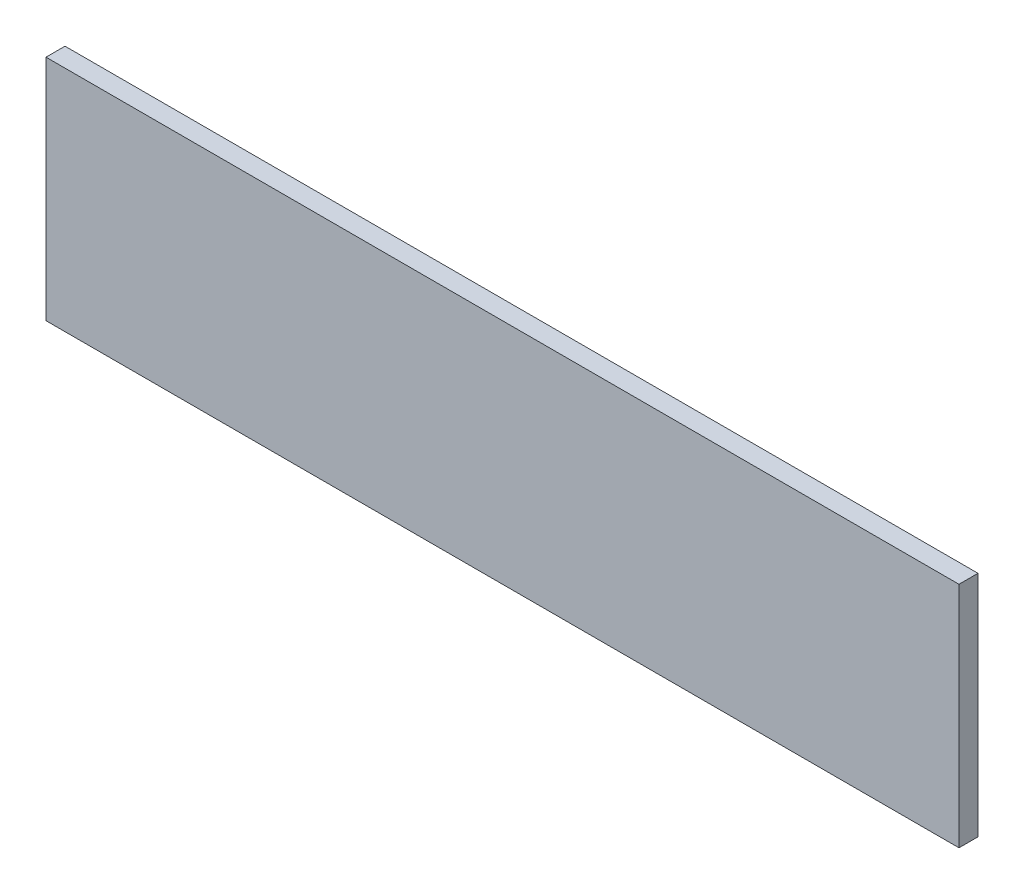
ISO-10303-21;
HEADER;
FILE_DESCRIPTION(('STEP AP214'),'2;1');
FILE_NAME('part.step','',(''),(''),'','','');
FILE_SCHEMA(('AUTOMOTIVE_DESIGN { 1 0 10303 214 1 1 1 1 }'));
ENDSEC;
DATA;
#1=APPLICATION_CONTEXT('core data for automotive mechanical design processes');
#2=APPLICATION_PROTOCOL_DEFINITION('international standard','automotive_design',2000,#1);
#3=PRODUCT_CONTEXT('',#1,'mechanical');
#4=PRODUCT('Part','Part','',(#3));
#5=PRODUCT_RELATED_PRODUCT_CATEGORY('part','',(#4));
#6=PRODUCT_DEFINITION_FORMATION('','',#4);
#7=PRODUCT_DEFINITION_CONTEXT('part definition',#1,'design');
#8=PRODUCT_DEFINITION('design','',#6,#7);
#9=PRODUCT_DEFINITION_SHAPE('','',#8);
#10=(LENGTH_UNIT() NAMED_UNIT(*) SI_UNIT(.MILLI.,.METRE.));
#11=(NAMED_UNIT(*) PLANE_ANGLE_UNIT() SI_UNIT($,.RADIAN.));
#12=(NAMED_UNIT(*) SI_UNIT($,.STERADIAN.) SOLID_ANGLE_UNIT());
#13=UNCERTAINTY_MEASURE_WITH_UNIT(LENGTH_MEASURE(1.E-05),#10,'distance_accuracy_value','');
#14=(GEOMETRIC_REPRESENTATION_CONTEXT(3) GLOBAL_UNCERTAINTY_ASSIGNED_CONTEXT((#13)) GLOBAL_UNIT_ASSIGNED_CONTEXT((#10,
#11,#12)) REPRESENTATION_CONTEXT('',''));
#15=CARTESIAN_POINT('',(0.,0.,0.));
#16=DIRECTION('',(0.,0.,1.));
#17=DIRECTION('',(1.,0.,0.));
#18=AXIS2_PLACEMENT_3D('',#15,#16,#17);
#19=CARTESIAN_POINT('',(0.,0.,6.35));
#20=DIRECTION('',(1.,0.,0.));
#21=DIRECTION('',(0.,0.,-1.));
#22=AXIS2_PLACEMENT_3D('',#19,#20,#21);
#23=PLANE('',#22);
#24=DIRECTION('',(0.,-1.,0.));
#25=VECTOR('',#24,1.);
#26=CARTESIAN_POINT('',(0.,0.,0.));
#27=LINE('',#26,#25);
#28=CARTESIAN_POINT('',(0.,76.2,0.));
#29=VERTEX_POINT('',#28);
#30=CARTESIAN_POINT('',(0.,0.,0.));
#31=VERTEX_POINT('',#30);
#32=EDGE_CURVE('E96',#29,#31,#27,.T.);
#33=ORIENTED_EDGE('',*,*,#32,.T.);
#34=DIRECTION('',(0.,0.,-1.));
#35=VECTOR('',#34,1.);
#36=CARTESIAN_POINT('',(0.,0.,6.35));
#37=LINE('',#36,#35);
#38=CARTESIAN_POINT('',(0.,0.,6.35));
#39=VERTEX_POINT('',#38);
#40=EDGE_CURVE('E11',#39,#31,#37,.T.);
#41=ORIENTED_EDGE('',*,*,#40,.F.);
#42=DIRECTION('',(0.,-1.,0.));
#43=VECTOR('',#42,1.);
#44=CARTESIAN_POINT('',(0.,0.,6.35));
#45=LINE('',#44,#43);
#46=CARTESIAN_POINT('',(0.,76.2,6.35));
#47=VERTEX_POINT('',#46);
#48=EDGE_CURVE('E84',#47,#39,#45,.T.);
#49=ORIENTED_EDGE('',*,*,#48,.F.);
#50=DIRECTION('',(0.,0.,-1.));
#51=VECTOR('',#50,1.);
#52=CARTESIAN_POINT('',(0.,76.2,6.35));
#53=LINE('',#52,#51);
#54=EDGE_CURVE('E92',#47,#29,#53,.T.);
#55=ORIENTED_EDGE('',*,*,#54,.T.);
#56=EDGE_LOOP('',(#33,#41,#49,#55));
#57=FACE_BOUND('',#56,.T.);
#58=ADVANCED_FACE('F33',(#57),#23,.F.);
#59=CARTESIAN_POINT('',(0.,0.,6.35));
#60=DIRECTION('',(0.,1.,0.));
#61=DIRECTION('',(0.,0.,1.));
#62=AXIS2_PLACEMENT_3D('',#59,#60,#61);
#63=PLANE('',#62);
#64=DIRECTION('',(1.,0.,0.));
#65=VECTOR('',#64,1.);
#66=CARTESIAN_POINT('',(0.,0.,0.));
#67=LINE('',#66,#65);
#68=CARTESIAN_POINT('',(304.8,0.,0.));
#69=VERTEX_POINT('',#68);
#70=EDGE_CURVE('E88',#31,#69,#67,.T.);
#71=ORIENTED_EDGE('',*,*,#70,.T.);
#72=DIRECTION('',(0.,0.,-1.));
#73=VECTOR('',#72,1.);
#74=CARTESIAN_POINT('',(304.8,0.,6.35));
#75=LINE('',#74,#73);
#76=CARTESIAN_POINT('',(304.8,0.,6.35));
#77=VERTEX_POINT('',#76);
#78=EDGE_CURVE('E41',#77,#69,#75,.T.);
#79=ORIENTED_EDGE('',*,*,#78,.F.);
#80=DIRECTION('',(1.,0.,0.));
#81=VECTOR('',#80,1.);
#82=CARTESIAN_POINT('',(0.,0.,6.35));
#83=LINE('',#82,#81);
#84=EDGE_CURVE('E79',#39,#77,#83,.T.);
#85=ORIENTED_EDGE('',*,*,#84,.F.);
#86=ORIENTED_EDGE('',*,*,#40,.T.);
#87=EDGE_LOOP('',(#71,#79,#85,#86));
#88=FACE_BOUND('',#87,.T.);
#89=ADVANCED_FACE('F87',(#88),#63,.F.);
#90=CARTESIAN_POINT('',(304.8,0.,6.35));
#91=DIRECTION('',(-1.,0.,0.));
#92=DIRECTION('',(0.,0.,1.));
#93=AXIS2_PLACEMENT_3D('',#90,#91,#92);
#94=PLANE('',#93);
#95=DIRECTION('',(0.,1.,0.));
#96=VECTOR('',#95,1.);
#97=CARTESIAN_POINT('',(304.8,0.,0.));
#98=LINE('',#97,#96);
#99=CARTESIAN_POINT('',(304.8,76.2,0.));
#100=VERTEX_POINT('',#99);
#101=EDGE_CURVE('E66',#69,#100,#98,.T.);
#102=ORIENTED_EDGE('',*,*,#101,.T.);
#103=DIRECTION('',(0.,0.,-1.));
#104=VECTOR('',#103,1.);
#105=CARTESIAN_POINT('',(304.8,76.2,6.35));
#106=LINE('',#105,#104);
#107=CARTESIAN_POINT('',(304.8,76.2,6.35));
#108=VERTEX_POINT('',#107);
#109=EDGE_CURVE('E89',#108,#100,#106,.T.);
#110=ORIENTED_EDGE('',*,*,#109,.F.);
#111=DIRECTION('',(0.,1.,0.));
#112=VECTOR('',#111,1.);
#113=CARTESIAN_POINT('',(304.8,0.,6.35));
#114=LINE('',#113,#112);
#115=EDGE_CURVE('E82',#77,#108,#114,.T.);
#116=ORIENTED_EDGE('',*,*,#115,.F.);
#117=ORIENTED_EDGE('',*,*,#78,.T.);
#118=EDGE_LOOP('',(#102,#110,#116,#117));
#119=FACE_BOUND('',#118,.T.);
#120=ADVANCED_FACE('F90',(#119),#94,.F.);
#121=CARTESIAN_POINT('',(0.,76.2,6.35));
#122=DIRECTION('',(0.,-1.,0.));
#123=DIRECTION('',(0.,0.,-1.));
#124=AXIS2_PLACEMENT_3D('',#121,#122,#123);
#125=PLANE('',#124);
#126=DIRECTION('',(-1.,0.,0.));
#127=VECTOR('',#126,1.);
#128=CARTESIAN_POINT('',(0.,76.2,0.));
#129=LINE('',#128,#127);
#130=EDGE_CURVE('E72',#100,#29,#129,.T.);
#131=ORIENTED_EDGE('',*,*,#130,.T.);
#132=ORIENTED_EDGE('',*,*,#54,.F.);
#133=DIRECTION('',(-1.,0.,0.));
#134=VECTOR('',#133,1.);
#135=CARTESIAN_POINT('',(0.,76.2,6.35));
#136=LINE('',#135,#134);
#137=EDGE_CURVE('E49',#108,#47,#136,.T.);
#138=ORIENTED_EDGE('',*,*,#137,.F.);
#139=ORIENTED_EDGE('',*,*,#109,.T.);
#140=EDGE_LOOP('',(#131,#132,#138,#139));
#141=FACE_BOUND('',#140,.T.);
#142=ADVANCED_FACE('F103',(#141),#125,.F.);
#143=CARTESIAN_POINT('',(0.,0.,6.35));
#144=DIRECTION('',(0.,0.,-1.));
#145=DIRECTION('',(-1.,0.,0.));
#146=AXIS2_PLACEMENT_3D('',#143,#144,#145);
#147=PLANE('',#146);
#148=ORIENTED_EDGE('',*,*,#48,.T.);
#149=ORIENTED_EDGE('',*,*,#84,.T.);
#150=ORIENTED_EDGE('',*,*,#115,.T.);
#151=ORIENTED_EDGE('',*,*,#137,.T.);
#152=EDGE_LOOP('',(#148,#149,#150,#151));
#153=FACE_BOUND('',#152,.T.);
#154=ADVANCED_FACE('F80',(#153),#147,.F.);
#155=CARTESIAN_POINT('',(0.,0.,0.));
#156=DIRECTION('',(0.,0.,-1.));
#157=DIRECTION('',(-1.,0.,0.));
#158=AXIS2_PLACEMENT_3D('',#155,#156,#157);
#159=PLANE('',#158);
#160=ORIENTED_EDGE('',*,*,#32,.F.);
#161=ORIENTED_EDGE('',*,*,#130,.F.);
#162=ORIENTED_EDGE('',*,*,#101,.F.);
#163=ORIENTED_EDGE('',*,*,#70,.F.);
#164=EDGE_LOOP('',(#160,#161,#162,#163));
#165=FACE_BOUND('',#164,.T.);
#166=ADVANCED_FACE('F106',(#165),#159,.T.);
#167=CLOSED_SHELL('',(#58,#89,#120,#142,#154,#166));
#168=MANIFOLD_SOLID_BREP('B2',#167);
#169=ADVANCED_BREP_SHAPE_REPRESENTATION('',(#18,#168),#14);
#170=SHAPE_DEFINITION_REPRESENTATION(#9,#169);
ENDSEC;
END-ISO-10303-21;
